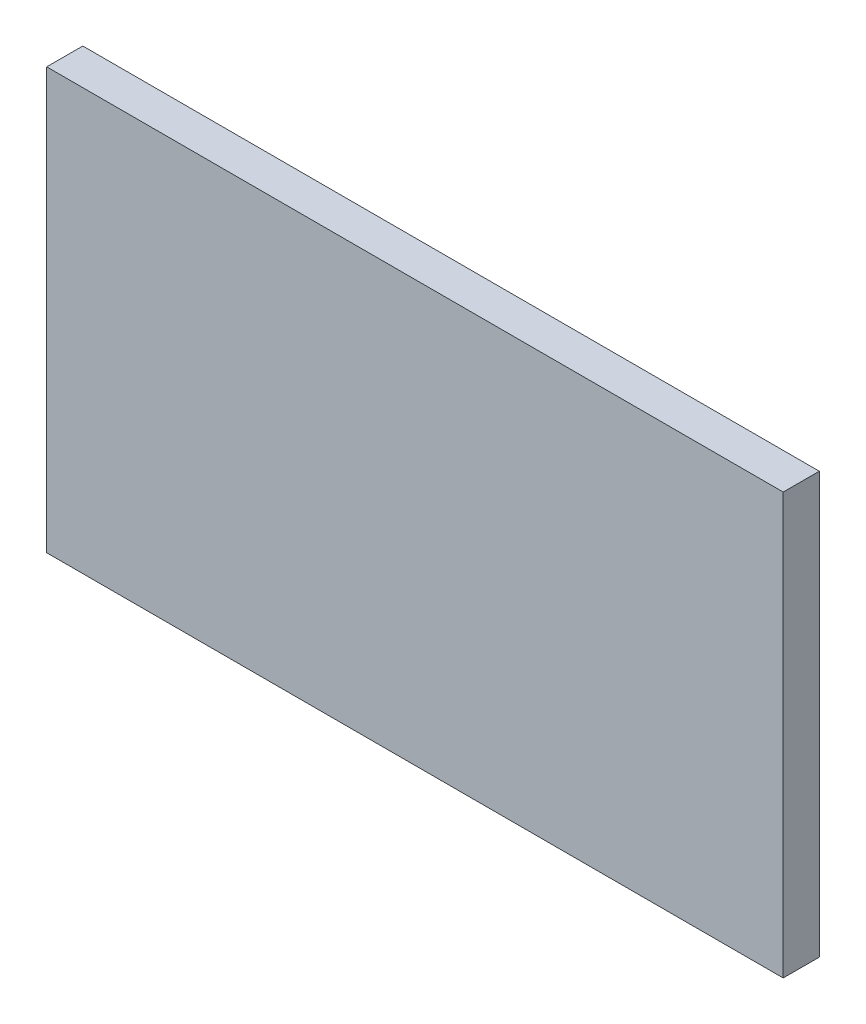
ISO-10303-21;
HEADER;
FILE_DESCRIPTION(('STEP AP214'),'2;1');
FILE_NAME('part.step','',(''),(''),'','','');
FILE_SCHEMA(('AUTOMOTIVE_DESIGN { 1 0 10303 214 1 1 1 1 }'));
ENDSEC;
DATA;
#1=APPLICATION_CONTEXT('core data for automotive mechanical design processes');
#2=APPLICATION_PROTOCOL_DEFINITION('international standard','automotive_design',2000,#1);
#3=PRODUCT_CONTEXT('',#1,'mechanical');
#4=PRODUCT('Part','Part','',(#3));
#5=PRODUCT_RELATED_PRODUCT_CATEGORY('part','',(#4));
#6=PRODUCT_DEFINITION_FORMATION('','',#4);
#7=PRODUCT_DEFINITION_CONTEXT('part definition',#1,'design');
#8=PRODUCT_DEFINITION('design','',#6,#7);
#9=PRODUCT_DEFINITION_SHAPE('','',#8);
#10=(LENGTH_UNIT() NAMED_UNIT(*) SI_UNIT(.MILLI.,.METRE.));
#11=(NAMED_UNIT(*) PLANE_ANGLE_UNIT() SI_UNIT($,.RADIAN.));
#12=(NAMED_UNIT(*) SI_UNIT($,.STERADIAN.) SOLID_ANGLE_UNIT());
#13=UNCERTAINTY_MEASURE_WITH_UNIT(LENGTH_MEASURE(1.E-05),#10,'distance_accuracy_value','');
#14=(GEOMETRIC_REPRESENTATION_CONTEXT(3) GLOBAL_UNCERTAINTY_ASSIGNED_CONTEXT((#13)) GLOBAL_UNIT_ASSIGNED_CONTEXT((#10,
#11,#12)) REPRESENTATION_CONTEXT('',''));
#15=CARTESIAN_POINT('',(0.,0.,0.));
#16=DIRECTION('',(0.,0.,1.));
#17=DIRECTION('',(1.,0.,0.));
#18=AXIS2_PLACEMENT_3D('',#15,#16,#17);
#19=CARTESIAN_POINT('',(1.65,7.3716,0.76487));
#20=DIRECTION('',(0.,0.,-1.));
#21=DIRECTION('',(0.,1.,0.));
#22=AXIS2_PLACEMENT_3D('',#19,#20,#21);
#23=PLANE('',#22);
#24=DIRECTION('',(1.,0.,0.));
#25=VECTOR('',#24,1.);
#26=CARTESIAN_POINT('',(1.3,7.5716,0.76487));
#27=LINE('',#26,#25);
#28=CARTESIAN_POINT('',(1.3,7.5716,0.76487));
#29=VERTEX_POINT('',#28);
#30=CARTESIAN_POINT('',(2.,7.5716,0.76487));
#31=VERTEX_POINT('',#30);
#32=EDGE_CURVE('E55',#29,#31,#27,.T.);
#33=ORIENTED_EDGE('',*,*,#32,.T.);
#34=DIRECTION('',(0.,1.,0.));
#35=VECTOR('',#34,1.);
#36=CARTESIAN_POINT('',(2.,7.5716,0.76487));
#37=LINE('',#36,#35);
#38=CARTESIAN_POINT('',(2.,7.1716,0.76487));
#39=VERTEX_POINT('',#38);
#40=EDGE_CURVE('E57',#31,#39,#37,.F.);
#41=ORIENTED_EDGE('',*,*,#40,.T.);
#42=DIRECTION('',(1.,0.,0.));
#43=VECTOR('',#42,1.);
#44=CARTESIAN_POINT('',(2.,7.1716,0.76487));
#45=LINE('',#44,#43);
#46=CARTESIAN_POINT('',(1.3,7.1716,0.76487));
#47=VERTEX_POINT('',#46);
#48=EDGE_CURVE('E20',#39,#47,#45,.F.);
#49=ORIENTED_EDGE('',*,*,#48,.T.);
#50=DIRECTION('',(0.,1.,0.));
#51=VECTOR('',#50,1.);
#52=CARTESIAN_POINT('',(1.3,7.1716,0.76487));
#53=LINE('',#52,#51);
#54=EDGE_CURVE('E80',#47,#29,#53,.T.);
#55=ORIENTED_EDGE('',*,*,#54,.T.);
#56=EDGE_LOOP('',(#33,#41,#49,#55));
#57=FACE_BOUND('',#56,.T.);
#58=ADVANCED_FACE('F17',(#57),#23,.T.);
#59=CARTESIAN_POINT('',(2.,7.1716,0.76487));
#60=DIRECTION('',(0.,1.,0.));
#61=DIRECTION('',(0.,0.,1.));
#62=AXIS2_PLACEMENT_3D('',#59,#60,#61);
#63=PLANE('',#62);
#64=DIRECTION('',(0.,0.,1.));
#65=VECTOR('',#64,1.);
#66=CARTESIAN_POINT('',(1.3,7.1716,0.76487));
#67=LINE('',#66,#65);
#68=CARTESIAN_POINT('',(1.3,7.1716,0.79916));
#69=VERTEX_POINT('',#68);
#70=EDGE_CURVE('E68',#69,#47,#67,.F.);
#71=ORIENTED_EDGE('',*,*,#70,.T.);
#72=ORIENTED_EDGE('',*,*,#48,.F.);
#73=DIRECTION('',(0.,0.,1.));
#74=VECTOR('',#73,1.);
#75=CARTESIAN_POINT('',(2.,7.1716,0.76487));
#76=LINE('',#75,#74);
#77=CARTESIAN_POINT('',(2.,7.1716,0.79916));
#78=VERTEX_POINT('',#77);
#79=EDGE_CURVE('E63',#39,#78,#76,.T.);
#80=ORIENTED_EDGE('',*,*,#79,.T.);
#81=DIRECTION('',(1.,0.,0.));
#82=VECTOR('',#81,1.);
#83=CARTESIAN_POINT('',(1.65,7.1716,0.79916));
#84=LINE('',#83,#82);
#85=EDGE_CURVE('E83',#69,#78,#84,.T.);
#86=ORIENTED_EDGE('',*,*,#85,.F.);
#87=EDGE_LOOP('',(#71,#72,#80,#86));
#88=FACE_BOUND('',#87,.T.);
#89=ADVANCED_FACE('F65',(#88),#63,.F.);
#90=CARTESIAN_POINT('',(2.,7.5716,0.76487));
#91=DIRECTION('',(-1.,0.,0.));
#92=DIRECTION('',(0.,0.,1.));
#93=AXIS2_PLACEMENT_3D('',#90,#91,#92);
#94=PLANE('',#93);
#95=ORIENTED_EDGE('',*,*,#79,.F.);
#96=ORIENTED_EDGE('',*,*,#40,.F.);
#97=DIRECTION('',(0.,0.,-1.));
#98=VECTOR('',#97,1.);
#99=CARTESIAN_POINT('',(2.,7.5716,0.76487));
#100=LINE('',#99,#98);
#101=CARTESIAN_POINT('',(2.,7.5716,0.79916));
#102=VERTEX_POINT('',#101);
#103=EDGE_CURVE('E75',#31,#102,#100,.F.);
#104=ORIENTED_EDGE('',*,*,#103,.T.);
#105=DIRECTION('',(0.,-1.,0.));
#106=VECTOR('',#105,1.);
#107=CARTESIAN_POINT('',(2.,7.3716,0.79916));
#108=LINE('',#107,#106);
#109=EDGE_CURVE('E72',#78,#102,#108,.F.);
#110=ORIENTED_EDGE('',*,*,#109,.F.);
#111=EDGE_LOOP('',(#95,#96,#104,#110));
#112=FACE_BOUND('',#111,.T.);
#113=ADVANCED_FACE('F70',(#112),#94,.F.);
#114=CARTESIAN_POINT('',(1.3,7.5716,0.76487));
#115=DIRECTION('',(0.,-1.,0.));
#116=DIRECTION('',(0.,0.,-1.));
#117=AXIS2_PLACEMENT_3D('',#114,#115,#116);
#118=PLANE('',#117);
#119=ORIENTED_EDGE('',*,*,#103,.F.);
#120=ORIENTED_EDGE('',*,*,#32,.F.);
#121=DIRECTION('',(0.,0.,1.));
#122=VECTOR('',#121,1.);
#123=CARTESIAN_POINT('',(1.3,7.5716,0.76487));
#124=LINE('',#123,#122);
#125=CARTESIAN_POINT('',(1.3,7.5716,0.79916));
#126=VERTEX_POINT('',#125);
#127=EDGE_CURVE('E35',#29,#126,#124,.T.);
#128=ORIENTED_EDGE('',*,*,#127,.T.);
#129=DIRECTION('',(1.,0.,0.));
#130=VECTOR('',#129,1.);
#131=CARTESIAN_POINT('',(1.65,7.5716,0.79916));
#132=LINE('',#131,#130);
#133=EDGE_CURVE('E26',#102,#126,#132,.F.);
#134=ORIENTED_EDGE('',*,*,#133,.F.);
#135=EDGE_LOOP('',(#119,#120,#128,#134));
#136=FACE_BOUND('',#135,.T.);
#137=ADVANCED_FACE('F89',(#136),#118,.F.);
#138=CARTESIAN_POINT('',(1.3,7.1716,0.76487));
#139=DIRECTION('',(1.,0.,0.));
#140=DIRECTION('',(0.,1.,0.));
#141=AXIS2_PLACEMENT_3D('',#138,#139,#140);
#142=PLANE('',#141);
#143=ORIENTED_EDGE('',*,*,#127,.F.);
#144=ORIENTED_EDGE('',*,*,#54,.F.);
#145=ORIENTED_EDGE('',*,*,#70,.F.);
#146=DIRECTION('',(0.,-1.,0.));
#147=VECTOR('',#146,1.);
#148=CARTESIAN_POINT('',(1.3,7.3716,0.79916));
#149=LINE('',#148,#147);
#150=EDGE_CURVE('E11',#126,#69,#149,.T.);
#151=ORIENTED_EDGE('',*,*,#150,.F.);
#152=EDGE_LOOP('',(#143,#144,#145,#151));
#153=FACE_BOUND('',#152,.T.);
#154=ADVANCED_FACE('F91',(#153),#142,.F.);
#155=CARTESIAN_POINT('',(1.65,7.3716,0.79916));
#156=DIRECTION('',(0.,0.,1.));
#157=DIRECTION('',(0.,-1.,0.));
#158=AXIS2_PLACEMENT_3D('',#155,#156,#157);
#159=PLANE('',#158);
#160=ORIENTED_EDGE('',*,*,#133,.T.);
#161=ORIENTED_EDGE('',*,*,#150,.T.);
#162=ORIENTED_EDGE('',*,*,#85,.T.);
#163=ORIENTED_EDGE('',*,*,#109,.T.);
#164=EDGE_LOOP('',(#160,#161,#162,#163));
#165=FACE_BOUND('',#164,.T.);
#166=ADVANCED_FACE('F88',(#165),#159,.T.);
#167=CLOSED_SHELL('',(#58,#89,#113,#137,#154,#166));
#168=MANIFOLD_SOLID_BREP('B1',#167);
#169=ADVANCED_BREP_SHAPE_REPRESENTATION('',(#18,#168),#14);
#170=SHAPE_DEFINITION_REPRESENTATION(#9,#169);
ENDSEC;
END-ISO-10303-21;
